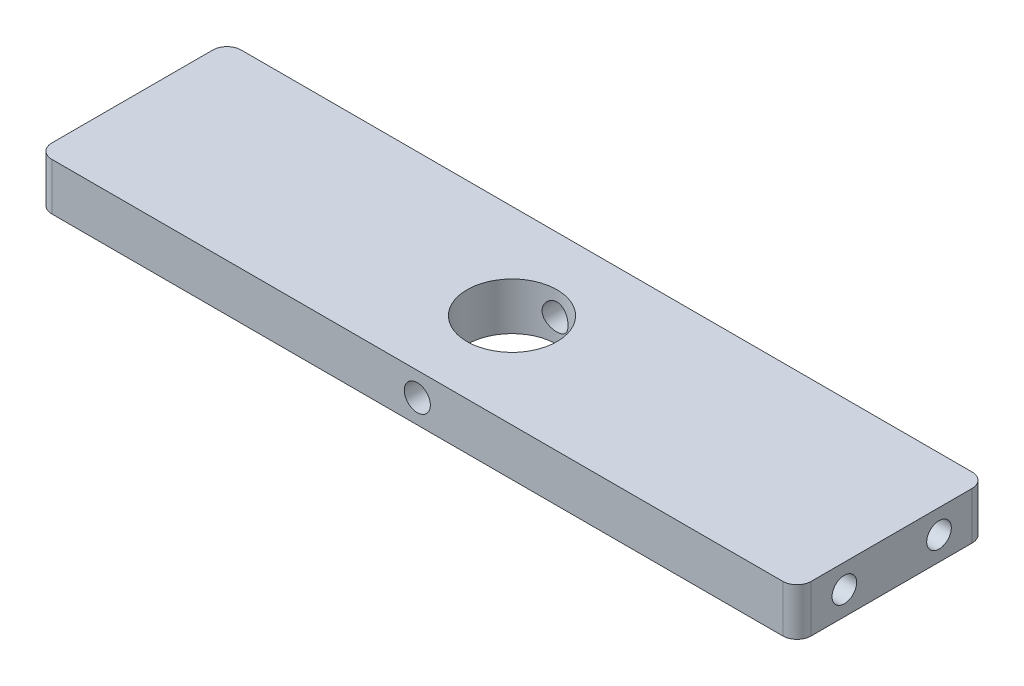
ISO-10303-21;
HEADER;
FILE_DESCRIPTION(('STEP AP214'),'2;1');
FILE_NAME('part.step','',(''),(''),'','','');
FILE_SCHEMA(('AUTOMOTIVE_DESIGN { 1 0 10303 214 1 1 1 1 }'));
ENDSEC;
DATA;
#1=APPLICATION_CONTEXT('core data for automotive mechanical design processes');
#2=APPLICATION_PROTOCOL_DEFINITION('international standard','automotive_design',2000,#1);
#3=PRODUCT_CONTEXT('',#1,'mechanical');
#4=PRODUCT('Part','Part','',(#3));
#5=PRODUCT_RELATED_PRODUCT_CATEGORY('part','',(#4));
#6=PRODUCT_DEFINITION_FORMATION('','',#4);
#7=PRODUCT_DEFINITION_CONTEXT('part definition',#1,'design');
#8=PRODUCT_DEFINITION('design','',#6,#7);
#9=PRODUCT_DEFINITION_SHAPE('','',#8);
#10=(LENGTH_UNIT() NAMED_UNIT(*) SI_UNIT(.MILLI.,.METRE.));
#11=(NAMED_UNIT(*) PLANE_ANGLE_UNIT() SI_UNIT($,.RADIAN.));
#12=(NAMED_UNIT(*) SI_UNIT($,.STERADIAN.) SOLID_ANGLE_UNIT());
#13=UNCERTAINTY_MEASURE_WITH_UNIT(LENGTH_MEASURE(1.E-05),#10,'distance_accuracy_value','');
#14=(GEOMETRIC_REPRESENTATION_CONTEXT(3) GLOBAL_UNCERTAINTY_ASSIGNED_CONTEXT((#13)) GLOBAL_UNIT_ASSIGNED_CONTEXT((#10,
#11,#12)) REPRESENTATION_CONTEXT('',''));
#15=CARTESIAN_POINT('',(0.,0.,0.));
#16=DIRECTION('',(0.,0.,1.));
#17=DIRECTION('',(1.,0.,0.));
#18=AXIS2_PLACEMENT_3D('',#15,#16,#17);
#19=CARTESIAN_POINT('',(0.,5.,0.));
#20=DIRECTION('',(0.,1.,0.));
#21=DIRECTION('',(0.,0.,1.));
#22=AXIS2_PLACEMENT_3D('',#19,#20,#21);
#23=PLANE('',#22);
#24=DIRECTION('',(1.,0.,0.));
#25=VECTOR('',#24,1.);
#26=CARTESIAN_POINT('',(80.2,5.,20.));
#27=LINE('',#26,#25);
#28=CARTESIAN_POINT('',(-77.2,5.,20.));
#29=VERTEX_POINT('',#28);
#30=CARTESIAN_POINT('',(77.2,5.,20.));
#31=VERTEX_POINT('',#30);
#32=EDGE_CURVE('E164',#29,#31,#27,.T.);
#33=ORIENTED_EDGE('',*,*,#32,.T.);
#34=CARTESIAN_POINT('',(77.2,5.,17.));
#35=DIRECTION('',(0.,1.,0.));
#36=DIRECTION('',(0.,0.,1.));
#37=AXIS2_PLACEMENT_3D('',#34,#35,#36);
#38=CIRCLE('',#37,3.);
#39=CARTESIAN_POINT('',(80.2,5.,17.));
#40=VERTEX_POINT('',#39);
#41=EDGE_CURVE('E204',#31,#40,#38,.T.);
#42=ORIENTED_EDGE('',*,*,#41,.T.);
#43=DIRECTION('',(0.,0.,-1.));
#44=VECTOR('',#43,1.);
#45=CARTESIAN_POINT('',(80.2,5.,20.));
#46=LINE('',#45,#44);
#47=CARTESIAN_POINT('',(80.2,5.,-17.));
#48=VERTEX_POINT('',#47);
#49=EDGE_CURVE('E168',#40,#48,#46,.T.);
#50=ORIENTED_EDGE('',*,*,#49,.T.);
#51=CARTESIAN_POINT('',(77.2,5.,-17.));
#52=DIRECTION('',(0.,1.,0.));
#53=DIRECTION('',(0.,0.,1.));
#54=AXIS2_PLACEMENT_3D('',#51,#52,#53);
#55=CIRCLE('',#54,3.);
#56=CARTESIAN_POINT('',(77.2,5.,-20.));
#57=VERTEX_POINT('',#56);
#58=EDGE_CURVE('E66',#48,#57,#55,.T.);
#59=ORIENTED_EDGE('',*,*,#58,.T.);
#60=DIRECTION('',(-1.,0.,0.));
#61=VECTOR('',#60,1.);
#62=CARTESIAN_POINT('',(80.2,5.,-20.));
#63=LINE('',#62,#61);
#64=CARTESIAN_POINT('',(-77.2,5.,-20.));
#65=VERTEX_POINT('',#64);
#66=EDGE_CURVE('E170',#57,#65,#63,.T.);
#67=ORIENTED_EDGE('',*,*,#66,.T.);
#68=CARTESIAN_POINT('',(-77.2,5.,-17.));
#69=DIRECTION('',(0.,1.,0.));
#70=DIRECTION('',(0.,0.,1.));
#71=AXIS2_PLACEMENT_3D('',#68,#69,#70);
#72=CIRCLE('',#71,3.);
#73=CARTESIAN_POINT('',(-80.2,5.,-17.));
#74=VERTEX_POINT('',#73);
#75=EDGE_CURVE('E199',#65,#74,#72,.T.);
#76=ORIENTED_EDGE('',*,*,#75,.T.);
#77=DIRECTION('',(0.,0.,1.));
#78=VECTOR('',#77,1.);
#79=CARTESIAN_POINT('',(-80.2,5.,20.));
#80=LINE('',#79,#78);
#81=CARTESIAN_POINT('',(-80.2,5.,17.));
#82=VERTEX_POINT('',#81);
#83=EDGE_CURVE('E161',#74,#82,#80,.T.);
#84=ORIENTED_EDGE('',*,*,#83,.T.);
#85=CARTESIAN_POINT('',(-77.2,5.,17.));
#86=DIRECTION('',(0.,1.,0.));
#87=DIRECTION('',(0.,0.,1.));
#88=AXIS2_PLACEMENT_3D('',#85,#86,#87);
#89=CIRCLE('',#88,3.);
#90=EDGE_CURVE('E201',#82,#29,#89,.T.);
#91=ORIENTED_EDGE('',*,*,#90,.T.);
#92=EDGE_LOOP('',(#33,#42,#50,#59,#67,#76,#84,#91));
#93=FACE_BOUND('',#92,.T.);
#94=CARTESIAN_POINT('',(0.,5.,0.));
#95=DIRECTION('',(0.,1.,0.));
#96=DIRECTION('',(0.,0.,1.));
#97=AXIS2_PLACEMENT_3D('',#94,#95,#96);
#98=CIRCLE('',#97,9.5);
#99=CARTESIAN_POINT('',(0.,5.,9.50000000000001));
#100=VERTEX_POINT('',#99);
#101=EDGE_CURVE('E155',#100,#100,#98,.T.);
#102=ORIENTED_EDGE('',*,*,#101,.F.);
#103=EDGE_LOOP('',(#102));
#104=FACE_BOUND('',#103,.T.);
#105=ADVANCED_FACE('F37',(#93,#104),#23,.T.);
#106=CARTESIAN_POINT('',(0.,-5.,0.));
#107=DIRECTION('',(0.,1.,0.));
#108=DIRECTION('',(0.,0.,1.));
#109=AXIS2_PLACEMENT_3D('',#106,#107,#108);
#110=PLANE('',#109);
#111=DIRECTION('',(0.,0.,-1.));
#112=VECTOR('',#111,1.);
#113=CARTESIAN_POINT('',(80.2,-5.,20.));
#114=LINE('',#113,#112);
#115=CARTESIAN_POINT('',(80.2,-5.,17.));
#116=VERTEX_POINT('',#115);
#117=CARTESIAN_POINT('',(80.2,-5.,-17.));
#118=VERTEX_POINT('',#117);
#119=EDGE_CURVE('E178',#116,#118,#114,.T.);
#120=ORIENTED_EDGE('',*,*,#119,.F.);
#121=CARTESIAN_POINT('',(77.2,-5.,17.));
#122=DIRECTION('',(0.,1.,0.));
#123=DIRECTION('',(0.,0.,1.));
#124=AXIS2_PLACEMENT_3D('',#121,#122,#123);
#125=CIRCLE('',#124,3.);
#126=CARTESIAN_POINT('',(77.2,-5.,20.));
#127=VERTEX_POINT('',#126);
#128=EDGE_CURVE('E192',#116,#127,#125,.F.);
#129=ORIENTED_EDGE('',*,*,#128,.T.);
#130=DIRECTION('',(1.,0.,0.));
#131=VECTOR('',#130,1.);
#132=CARTESIAN_POINT('',(80.2,-5.,20.));
#133=LINE('',#132,#131);
#134=CARTESIAN_POINT('',(-77.2,-5.,20.));
#135=VERTEX_POINT('',#134);
#136=EDGE_CURVE('E175',#135,#127,#133,.T.);
#137=ORIENTED_EDGE('',*,*,#136,.F.);
#138=CARTESIAN_POINT('',(-77.2,-5.,17.));
#139=DIRECTION('',(0.,1.,0.));
#140=DIRECTION('',(0.,0.,1.));
#141=AXIS2_PLACEMENT_3D('',#138,#139,#140);
#142=CIRCLE('',#141,3.);
#143=CARTESIAN_POINT('',(-80.2,-5.,17.));
#144=VERTEX_POINT('',#143);
#145=EDGE_CURVE('E188',#135,#144,#142,.F.);
#146=ORIENTED_EDGE('',*,*,#145,.T.);
#147=DIRECTION('',(0.,0.,1.));
#148=VECTOR('',#147,1.);
#149=CARTESIAN_POINT('',(-80.2,-5.,20.));
#150=LINE('',#149,#148);
#151=CARTESIAN_POINT('',(-80.2,-5.,-17.));
#152=VERTEX_POINT('',#151);
#153=EDGE_CURVE('E158',#152,#144,#150,.T.);
#154=ORIENTED_EDGE('',*,*,#153,.F.);
#155=CARTESIAN_POINT('',(-77.2,-5.,-17.));
#156=DIRECTION('',(0.,1.,0.));
#157=DIRECTION('',(0.,0.,1.));
#158=AXIS2_PLACEMENT_3D('',#155,#156,#157);
#159=CIRCLE('',#158,3.);
#160=CARTESIAN_POINT('',(-77.2,-5.,-20.));
#161=VERTEX_POINT('',#160);
#162=EDGE_CURVE('E186',#152,#161,#159,.F.);
#163=ORIENTED_EDGE('',*,*,#162,.T.);
#164=DIRECTION('',(-1.,0.,0.));
#165=VECTOR('',#164,1.);
#166=CARTESIAN_POINT('',(80.2,-5.,-20.));
#167=LINE('',#166,#165);
#168=CARTESIAN_POINT('',(77.2,-5.,-20.));
#169=VERTEX_POINT('',#168);
#170=EDGE_CURVE('E165',#169,#161,#167,.T.);
#171=ORIENTED_EDGE('',*,*,#170,.F.);
#172=CARTESIAN_POINT('',(77.2,-5.,-17.));
#173=DIRECTION('',(0.,1.,0.));
#174=DIRECTION('',(0.,0.,1.));
#175=AXIS2_PLACEMENT_3D('',#172,#173,#174);
#176=CIRCLE('',#175,3.);
#177=EDGE_CURVE('E190',#169,#118,#176,.F.);
#178=ORIENTED_EDGE('',*,*,#177,.T.);
#179=EDGE_LOOP('',(#120,#129,#137,#146,#154,#163,#171,#178));
#180=FACE_BOUND('',#179,.T.);
#181=CARTESIAN_POINT('',(0.,-5.,0.));
#182=DIRECTION('',(0.,1.,0.));
#183=DIRECTION('',(0.,0.,1.));
#184=AXIS2_PLACEMENT_3D('',#181,#182,#183);
#185=CIRCLE('',#184,9.5);
#186=CARTESIAN_POINT('',(0.,-5.,9.50000000000001));
#187=VERTEX_POINT('',#186);
#188=EDGE_CURVE('E154',#187,#187,#185,.T.);
#189=ORIENTED_EDGE('',*,*,#188,.T.);
#190=EDGE_LOOP('',(#189));
#191=FACE_BOUND('',#190,.T.);
#192=ADVANCED_FACE('F259',(#180,#191),#110,.F.);
#193=CARTESIAN_POINT('',(-80.2,5.,20.));
#194=DIRECTION('',(1.,0.,0.));
#195=DIRECTION('',(0.,0.,-1.));
#196=AXIS2_PLACEMENT_3D('',#193,#194,#195);
#197=PLANE('',#196);
#198=CARTESIAN_POINT('',(-80.2,0.,-9.99999999999999));
#199=DIRECTION('',(-1.,0.,0.));
#200=DIRECTION('',(0.,0.,1.));
#201=AXIS2_PLACEMENT_3D('',#198,#199,#200);
#202=CIRCLE('',#201,2.59999999999999);
#203=CARTESIAN_POINT('',(-80.2,0.,-7.4));
#204=VERTEX_POINT('',#203);
#205=EDGE_CURVE('E142',#204,#204,#202,.T.);
#206=ORIENTED_EDGE('',*,*,#205,.F.);
#207=EDGE_LOOP('',(#206));
#208=FACE_BOUND('',#207,.T.);
#209=CARTESIAN_POINT('',(-80.2,0.,10.));
#210=DIRECTION('',(-1.,0.,0.));
#211=DIRECTION('',(0.,0.,1.));
#212=AXIS2_PLACEMENT_3D('',#209,#210,#211);
#213=CIRCLE('',#212,2.59999999999999);
#214=CARTESIAN_POINT('',(-80.2,0.,12.6));
#215=VERTEX_POINT('',#214);
#216=EDGE_CURVE('E148',#215,#215,#213,.T.);
#217=ORIENTED_EDGE('',*,*,#216,.F.);
#218=EDGE_LOOP('',(#217));
#219=FACE_BOUND('',#218,.T.);
#220=ORIENTED_EDGE('',*,*,#153,.T.);
#221=DIRECTION('',(0.,-1.,0.));
#222=VECTOR('',#221,1.);
#223=CARTESIAN_POINT('',(-80.2,5.,17.));
#224=LINE('',#223,#222);
#225=EDGE_CURVE('E11',#144,#82,#224,.F.);
#226=ORIENTED_EDGE('',*,*,#225,.T.);
#227=ORIENTED_EDGE('',*,*,#83,.F.);
#228=DIRECTION('',(0.,-1.,0.));
#229=VECTOR('',#228,1.);
#230=CARTESIAN_POINT('',(-80.2,5.,-17.));
#231=LINE('',#230,#229);
#232=EDGE_CURVE('E51',#74,#152,#231,.T.);
#233=ORIENTED_EDGE('',*,*,#232,.T.);
#234=EDGE_LOOP('',(#220,#226,#227,#233));
#235=FACE_BOUND('',#234,.T.);
#236=ADVANCED_FACE('F263',(#208,#219,#235),#197,.F.);
#237=CARTESIAN_POINT('',(80.2,5.,20.));
#238=DIRECTION('',(0.,0.,-1.));
#239=DIRECTION('',(-1.,0.,0.));
#240=AXIS2_PLACEMENT_3D('',#237,#238,#239);
#241=PLANE('',#240);
#242=CARTESIAN_POINT('',(0.,0.,20.));
#243=DIRECTION('',(0.,0.,-1.));
#244=DIRECTION('',(-1.,0.,0.));
#245=AXIS2_PLACEMENT_3D('',#242,#243,#244);
#246=CIRCLE('',#245,2.74999999999999);
#247=CARTESIAN_POINT('',(-2.74999999999999,0.,20.));
#248=VERTEX_POINT('',#247);
#249=EDGE_CURVE('E216',#248,#248,#246,.T.);
#250=ORIENTED_EDGE('',*,*,#249,.T.);
#251=EDGE_LOOP('',(#250));
#252=FACE_BOUND('',#251,.T.);
#253=ORIENTED_EDGE('',*,*,#136,.T.);
#254=DIRECTION('',(0.,-1.,0.));
#255=VECTOR('',#254,1.);
#256=CARTESIAN_POINT('',(77.2,5.,20.));
#257=LINE('',#256,#255);
#258=EDGE_CURVE('E197',#127,#31,#257,.F.);
#259=ORIENTED_EDGE('',*,*,#258,.T.);
#260=ORIENTED_EDGE('',*,*,#32,.F.);
#261=DIRECTION('',(0.,-1.,0.));
#262=VECTOR('',#261,1.);
#263=CARTESIAN_POINT('',(-77.2,5.,20.));
#264=LINE('',#263,#262);
#265=EDGE_CURVE('E194',#29,#135,#264,.T.);
#266=ORIENTED_EDGE('',*,*,#265,.T.);
#267=EDGE_LOOP('',(#253,#259,#260,#266));
#268=FACE_BOUND('',#267,.T.);
#269=ADVANCED_FACE('F274',(#252,#268),#241,.F.);
#270=CARTESIAN_POINT('',(80.2,5.,20.));
#271=DIRECTION('',(-1.,0.,0.));
#272=DIRECTION('',(0.,0.,1.));
#273=AXIS2_PLACEMENT_3D('',#270,#271,#272);
#274=PLANE('',#273);
#275=CARTESIAN_POINT('',(80.2,0.,-9.99999999999999));
#276=DIRECTION('',(1.,0.,0.));
#277=DIRECTION('',(0.,0.,-1.));
#278=AXIS2_PLACEMENT_3D('',#275,#276,#277);
#279=CIRCLE('',#278,2.59999999999999);
#280=CARTESIAN_POINT('',(80.2,0.,-12.6));
#281=VERTEX_POINT('',#280);
#282=EDGE_CURVE('E131',#281,#281,#279,.T.);
#283=ORIENTED_EDGE('',*,*,#282,.F.);
#284=EDGE_LOOP('',(#283));
#285=FACE_BOUND('',#284,.T.);
#286=CARTESIAN_POINT('',(80.2,0.,10.));
#287=DIRECTION('',(1.,0.,0.));
#288=DIRECTION('',(0.,0.,-1.));
#289=AXIS2_PLACEMENT_3D('',#286,#287,#288);
#290=CIRCLE('',#289,2.59999999999999);
#291=CARTESIAN_POINT('',(80.2,0.,7.40000000000002));
#292=VERTEX_POINT('',#291);
#293=EDGE_CURVE('E130',#292,#292,#290,.T.);
#294=ORIENTED_EDGE('',*,*,#293,.F.);
#295=EDGE_LOOP('',(#294));
#296=FACE_BOUND('',#295,.T.);
#297=ORIENTED_EDGE('',*,*,#49,.F.);
#298=DIRECTION('',(0.,-1.,0.));
#299=VECTOR('',#298,1.);
#300=CARTESIAN_POINT('',(80.2,5.,17.));
#301=LINE('',#300,#299);
#302=EDGE_CURVE('E183',#40,#116,#301,.T.);
#303=ORIENTED_EDGE('',*,*,#302,.T.);
#304=ORIENTED_EDGE('',*,*,#119,.T.);
#305=DIRECTION('',(0.,-1.,0.));
#306=VECTOR('',#305,1.);
#307=CARTESIAN_POINT('',(80.2,5.,-17.));
#308=LINE('',#307,#306);
#309=EDGE_CURVE('E172',#118,#48,#308,.F.);
#310=ORIENTED_EDGE('',*,*,#309,.T.);
#311=EDGE_LOOP('',(#297,#303,#304,#310));
#312=FACE_BOUND('',#311,.T.);
#313=ADVANCED_FACE('F270',(#285,#296,#312),#274,.F.);
#314=CARTESIAN_POINT('',(80.2,5.,-20.));
#315=DIRECTION('',(0.,0.,1.));
#316=DIRECTION('',(1.,0.,0.));
#317=AXIS2_PLACEMENT_3D('',#314,#315,#316);
#318=PLANE('',#317);
#319=CARTESIAN_POINT('',(0.,0.,-20.));
#320=DIRECTION('',(0.,0.,-1.));
#321=DIRECTION('',(-1.,0.,0.));
#322=AXIS2_PLACEMENT_3D('',#319,#320,#321);
#323=CIRCLE('',#322,2.74999999999999);
#324=CARTESIAN_POINT('',(-2.74999999999999,0.,-20.));
#325=VERTEX_POINT('',#324);
#326=EDGE_CURVE('E487',#325,#325,#323,.T.);
#327=ORIENTED_EDGE('',*,*,#326,.F.);
#328=EDGE_LOOP('',(#327));
#329=FACE_BOUND('',#328,.T.);
#330=ORIENTED_EDGE('',*,*,#66,.F.);
#331=DIRECTION('',(0.,-1.,0.));
#332=VECTOR('',#331,1.);
#333=CARTESIAN_POINT('',(77.2,5.,-20.));
#334=LINE('',#333,#332);
#335=EDGE_CURVE('E207',#57,#169,#334,.T.);
#336=ORIENTED_EDGE('',*,*,#335,.T.);
#337=ORIENTED_EDGE('',*,*,#170,.T.);
#338=DIRECTION('',(0.,-1.,0.));
#339=VECTOR('',#338,1.);
#340=CARTESIAN_POINT('',(-77.2,5.,-20.));
#341=LINE('',#340,#339);
#342=EDGE_CURVE('E59',#161,#65,#341,.F.);
#343=ORIENTED_EDGE('',*,*,#342,.T.);
#344=EDGE_LOOP('',(#330,#336,#337,#343));
#345=FACE_BOUND('',#344,.T.);
#346=ADVANCED_FACE('F255',(#329,#345),#318,.F.);
#347=CARTESIAN_POINT('',(0.,5.,0.));
#348=DIRECTION('',(0.,-1.,0.));
#349=DIRECTION('',(0.,0.,-1.));
#350=AXIS2_PLACEMENT_3D('',#347,#348,#349);
#351=CYLINDRICAL_SURFACE('',#350,9.5);
#352=CARTESIAN_POINT('',(0.,2.74999999999999,-9.49999999999999));
#353=CARTESIAN_POINT('',(-0.151103684405157,2.74999754124777,-9.49999832244704));
#354=CARTESIAN_POINT('',(-0.302232490543062,2.73750454335048,-9.49636009363154));
#355=CARTESIAN_POINT('',(-0.600104468590077,2.68797129048408,-9.48220118050607));
#356=CARTESIAN_POINT('',(-0.746846052747299,2.65092225834138,-9.47167803530685));
#357=CARTESIAN_POINT('',(-1.03160321111771,2.55360637078811,-9.44490511841536));
#358=CARTESIAN_POINT('',(-1.16963081556959,2.49337237751823,-9.42866345486217));
#359=CARTESIAN_POINT('',(-1.43362680551053,2.35152697754196,-9.39215081459136));
#360=CARTESIAN_POINT('',(-1.55959383673314,2.26991317395903,-9.37187938616094));
#361=CARTESIAN_POINT('',(-1.79928390939949,2.08530821731493,-9.32886791379249));
#362=CARTESIAN_POINT('',(-1.91263626798143,1.98184695218117,-9.30607995192475));
#363=CARTESIAN_POINT('',(-2.12064810193771,1.75748683780256,-9.26089657094851));
#364=CARTESIAN_POINT('',(-2.21530468820945,1.63658529845747,-9.23850121299656));
#365=CARTESIAN_POINT('',(-2.3851412003241,1.37769858838737,-9.1961374284627));
#366=CARTESIAN_POINT('',(-2.45987724499969,1.23941151163317,-9.17622885775419));
#367=CARTESIAN_POINT('',(-2.58488523493734,0.951563505842819,-9.14180519471755));
#368=CARTESIAN_POINT('',(-2.63516260005811,0.802005082942984,-9.12728890766878));
#369=CARTESIAN_POINT('',(-2.70850546492159,0.500004433916435,-9.1057912455198));
#370=CARTESIAN_POINT('',(-2.73225075845376,0.347741018028173,-9.09862204672375));
#371=CARTESIAN_POINT('',(-2.75397717672036,0.0412359070571991,-9.09207071188814));
#372=CARTESIAN_POINT('',(-2.75196406431899,-0.113005337816634,-9.09268683405768));
#373=CARTESIAN_POINT('',(-2.72276662670943,-0.413634335356509,-9.10146952020892));
#374=CARTESIAN_POINT('',(-2.69642417137727,-0.560112434957022,-9.10938354042197));
#375=CARTESIAN_POINT('',(-2.62067211905443,-0.846474583113476,-9.13146312538767));
#376=CARTESIAN_POINT('',(-2.5712603872788,-0.986358020093244,-9.1456292686927));
#377=CARTESIAN_POINT('',(-2.45013108041959,-1.25766325857889,-9.17882509752256));
#378=CARTESIAN_POINT('',(-2.37813330895177,-1.38895224019629,-9.19791530942063));
#379=CARTESIAN_POINT('',(-2.21407061426737,-1.63787169462001,-9.23877807968907));
#380=CARTESIAN_POINT('',(-2.12200112000823,-1.75549904682108,-9.26055124857193));
#381=CARTESIAN_POINT('',(-1.91618685498142,-1.97854309496557,-9.3053597726663));
#382=CARTESIAN_POINT('',(-1.80174061950394,-2.08331030255787,-9.32841134979004));
#383=CARTESIAN_POINT('',(-1.55661714618185,-2.27231056222138,-9.37242908900899));
#384=CARTESIAN_POINT('',(-1.42593902284807,-2.35654249329973,-9.39339513722105));
#385=CARTESIAN_POINT('',(-1.15093833312673,-2.50243927488955,-9.43104916921502));
#386=CARTESIAN_POINT('',(-1.00654019019467,-2.56396878066789,-9.44771132340433));
#387=CARTESIAN_POINT('',(-0.708852909931501,-2.66168204194398,-9.47469408752444));
#388=CARTESIAN_POINT('',(-0.555566086357655,-2.69787236154338,-9.48501633971808));
#389=CARTESIAN_POINT('',(-0.24998107430183,-2.74281889776172,-9.49790021134739));
#390=CARTESIAN_POINT('',(-0.0978227914435337,-2.7524562282378,-9.50071098704387));
#391=CARTESIAN_POINT('',(0.205942559875623,-2.74648095244812,-9.49898138198389));
#392=CARTESIAN_POINT('',(0.357549694070784,-2.73087146342334,-9.49444190876729));
#393=CARTESIAN_POINT('',(0.652642778569646,-2.67556180638033,-9.47868434388846));
#394=CARTESIAN_POINT('',(0.79623201103296,-2.63636883617609,-9.46760695334968));
#395=CARTESIAN_POINT('',(1.0747718814908,-2.53560800406058,-9.44004611204557));
#396=CARTESIAN_POINT('',(1.20972150725607,-2.47403752598894,-9.4235620292044));
#397=CARTESIAN_POINT('',(1.47045331248785,-2.3287401729985,-9.38645317249359));
#398=CARTESIAN_POINT('',(1.59596781480529,-2.24455478541085,-9.3657451285769));
#399=CARTESIAN_POINT('',(1.83139177054953,-2.05698055414271,-9.32257224582276));
#400=CARTESIAN_POINT('',(1.94129756906272,-1.95358722579483,-9.30010699742408));
#401=CARTESIAN_POINT('',(2.14621104649742,-1.72639898636424,-9.25500783915002));
#402=CARTESIAN_POINT('',(2.24059318661215,-1.60203477635804,-9.23239367776249));
#403=CARTESIAN_POINT('',(2.40718239059993,-1.33874440341558,-9.19036893236843));
#404=CARTESIAN_POINT('',(2.47939018279238,-1.19981871895394,-9.17095824315311));
#405=CARTESIAN_POINT('',(2.59906135276598,-0.911894033414351,-9.13776453706623));
#406=CARTESIAN_POINT('',(2.64665229406023,-0.762951576021275,-9.12395259006894));
#407=CARTESIAN_POINT('',(2.71595633948742,-0.458698395809335,-9.10356585395777));
#408=CARTESIAN_POINT('',(2.73767754597491,-0.303389682662652,-9.09698879893802));
#409=CARTESIAN_POINT('',(2.75410126157505,0.00272100951974566,-9.09202893674775));
#410=CARTESIAN_POINT('',(2.74981852412951,0.153464301427592,-9.09333835862443));
#411=CARTESIAN_POINT('',(2.71675579324348,0.451982007282177,-9.10327026037627));
#412=CARTESIAN_POINT('',(2.68797665822231,0.599756525076961,-9.11189248399127));
#413=CARTESIAN_POINT('',(2.60737233149368,0.886608661207581,-9.13527934560715));
#414=CARTESIAN_POINT('',(2.55579824435838,1.02576270187393,-9.14997694724351));
#415=CARTESIAN_POINT('',(2.43126245291441,1.29355306042231,-9.18385041129181));
#416=CARTESIAN_POINT('',(2.35829688090382,1.42218747091165,-9.20302708341754));
#417=CARTESIAN_POINT('',(2.19012593088044,1.6700407247756,-9.24451630224842));
#418=CARTESIAN_POINT('',(2.09424562749777,1.78878745087847,-9.26691363088848));
#419=CARTESIAN_POINT('',(1.8842041101317,2.00883518550836,-9.31188982023243));
#420=CARTESIAN_POINT('',(1.77003826301001,2.11013175902883,-9.33446872556291));
#421=CARTESIAN_POINT('',(1.52301108308858,2.29507449070068,-9.37798262689348));
#422=CARTESIAN_POINT('',(1.38973368573321,2.37818030668016,-9.3988580217393));
#423=CARTESIAN_POINT('',(1.11049416144359,2.52068290210943,-9.43591993772834));
#424=CARTESIAN_POINT('',(0.964538760766332,2.58009216122512,-9.45210892570754));
#425=CARTESIAN_POINT('',(0.683003090577108,2.66738259861147,-9.47633414525844));
#426=CARTESIAN_POINT('',(0.548418661837644,2.69828426160835,-9.48513842472121));
#427=CARTESIAN_POINT('',(0.275896149880606,2.73959263042157,-9.49697170809104));
#428=CARTESIAN_POINT('',(0.137958545422938,2.75000224485511,-9.50000153161563));
#429=CARTESIAN_POINT('',(0.,2.74999999999999,-9.49999999999999));
#430=B_SPLINE_CURVE_WITH_KNOTS('',3,(#352,#353,#354,#355,#356,#357,#358,#359,#360,#361,#362,
#363,#364,#365,#366,#367,#368,#369,#370,#371,#372,#373,#374,#375,#376,#377,#378,#379,#380,#381,
#382,#383,#384,#385,#386,#387,#388,#389,#390,#391,#392,#393,#394,#395,#396,#397,#398,#399,#400,
#401,#402,#403,#404,#405,#406,#407,#408,#409,#410,#411,#412,#413,#414,#415,#416,#417,#418,#419,
#420,#421,#422,#423,#424,#425,#426,#427,#428,#429),.UNSPECIFIED.,.T.,.F.,(4,2,2,2,2,2,2,2,2,2,2,
2,2,2,2,2,2,2,2,2,2,2,2,2,2,2,2,2,2,2,2,2,2,2,2,2,2,2,4),(0.,0.452804573289333,
0.905771081895441,1.35809791035427,1.81047547059562,2.27381553554251,2.73722714561843,
3.21023444408136,3.68313687990035,4.14362319086672,4.60400648017588,5.04903287760034,
5.4941004650469,5.94492368071086,6.39584967224767,6.86424271505823,7.3326613210863,
7.80382901933557,8.27487461665875,8.73008958851485,9.18524835897749,9.63095163111832,
10.0767070273173,10.5322890334959,10.9879775428881,11.4589952340736,11.9299974529658,
12.3985338697172,12.8669235030808,13.3171557415862,13.7673722033992,14.2127481976107,
14.6582047680457,15.1188873659056,15.5796868753881,16.0527270031476,16.5255176768594,
16.9389895859487,17.3524028030901),.UNSPECIFIED.);
#431=CARTESIAN_POINT('',(0.,2.74999999999999,-9.49999999999999));
#432=VERTEX_POINT('',#431);
#433=EDGE_CURVE('E41',#432,#432,#430,.T.);
#434=ORIENTED_EDGE('',*,*,#433,.F.);
#435=EDGE_LOOP('',(#434));
#436=FACE_BOUND('',#435,.T.);
#437=CARTESIAN_POINT('',(-2.74999999999999,0.,9.09326673973662));
#438=CARTESIAN_POINT('',(-2.74999748739826,0.150953997952812,9.0932687234266));
#439=CARTESIAN_POINT('',(-2.73752836043792,0.30193320221528,9.09706676491743));
#440=CARTESIAN_POINT('',(-2.68809850739297,0.599495166690835,9.11179297629922));
#441=CARTESIAN_POINT('',(-2.65112828541667,0.7460761992712,9.12272391066089));
#442=CARTESIAN_POINT('',(-2.55404261737731,1.03049237957935,9.15037642687374));
#443=CARTESIAN_POINT('',(-2.49396369429824,1.16834093046682,9.16708886696219));
#444=CARTESIAN_POINT('',(-2.35248438083627,1.43203232307547,9.2044091953515));
#445=CARTESIAN_POINT('',(-2.2710812851814,1.55787363874416,9.22501757781518));
#446=CARTESIAN_POINT('',(-2.08669738026416,1.79768605462858,9.26848858321332));
#447=CARTESIAN_POINT('',(-1.98319895966932,1.91125102911558,9.29139667056131));
#448=CARTESIAN_POINT('',(-1.7586729151014,2.1196787486956,9.33649625564446));
#449=CARTESIAN_POINT('',(-1.63764319087852,2.21453924977346,9.35868766713176));
#450=CARTESIAN_POINT('',(-1.37862488560984,2.38460579860939,9.40036700016277));
#451=CARTESIAN_POINT('',(-1.24035617051953,2.45940113657735,9.4197950820437));
#452=CARTESIAN_POINT('',(-0.952546748651445,2.58452360437367,9.45323267734275));
#453=CARTESIAN_POINT('',(-0.803008304254653,2.63485563014175,9.46724327486865));
#454=CARTESIAN_POINT('',(-0.501150094253812,2.70828844620235,9.48794567226656));
#455=CARTESIAN_POINT('',(-0.34901175123507,2.73208169761808,9.49482323556994));
#456=CARTESIAN_POINT('',(-0.0427575868891259,2.75394753941673,9.50113730326528));
#457=CARTESIAN_POINT('',(0.111357840865043,2.75202517193673,9.50057526636177));
#458=CARTESIAN_POINT('',(0.412346021008186,2.7229866470039,9.49220634853773));
#459=CARTESIAN_POINT('',(0.55929798756627,2.69661977235507,9.48461494301188));
#460=CARTESIAN_POINT('',(0.846594418858577,2.62066022236096,9.46329962681945));
#461=CARTESIAN_POINT('',(0.986938476435692,2.57106611788768,9.44957533881047));
#462=CARTESIAN_POINT('',(1.25885921003556,2.44953101496587,9.41723137172921));
#463=CARTESIAN_POINT('',(1.39032097883386,2.37734754476926,9.39855892989722));
#464=CARTESIAN_POINT('',(1.63951063706876,2.21287253537106,9.35830968916391));
#465=CARTESIAN_POINT('',(1.75723544220935,2.12057649367597,9.33673224034829));
#466=CARTESIAN_POINT('',(1.98008241293625,1.91457948117918,9.29207535798244));
#467=CARTESIAN_POINT('',(2.0845985063612,1.80022768460242,9.26896981688192));
#468=CARTESIAN_POINT('',(2.27313434452746,1.55538915891514,9.22454700408495));
#469=CARTESIAN_POINT('',(2.35715233347622,1.42490104906865,9.20322988568079));
#470=CARTESIAN_POINT('',(2.50288155232304,1.14999160301189,9.16467885377943));
#471=CARTESIAN_POINT('',(2.56439983263043,1.00546261095701,9.14748067677288));
#472=CARTESIAN_POINT('',(2.6620528166619,0.707485933075982,9.1195440587038));
#473=CARTESIAN_POINT('',(2.69819513514645,0.554040937721674,9.10880367993903));
#474=CARTESIAN_POINT('',(2.74296654089158,0.248323982195786,9.09542000648067));
#475=CARTESIAN_POINT('',(2.75251131884848,0.0961977901220346,9.09250735225997));
#476=CARTESIAN_POINT('',(2.74636270896667,-0.207483134137307,9.09436660743294));
#477=CARTESIAN_POINT('',(2.73067256722487,-0.35903793731,9.0991375284491));
#478=CARTESIAN_POINT('',(2.67531246643312,-0.653551901521397,9.11556333018618));
#479=CARTESIAN_POINT('',(2.63621916462593,-0.796629625139111,9.12705251858283));
#480=CARTESIAN_POINT('',(2.53582439387691,-1.07418982938121,9.15545183534517));
#481=CARTESIAN_POINT('',(2.47451966099629,-1.20867104334192,9.17236276038544));
#482=CARTESIAN_POINT('',(2.32966586195411,-1.46898005406383,9.21023237443963));
#483=CARTESIAN_POINT('',(2.2455933821662,-1.59450294220978,9.23128262611337));
#484=CARTESIAN_POINT('',(2.05822094195759,-1.82999443224549,9.2748564163255));
#485=CARTESIAN_POINT('',(1.95491670148968,-1.93995956213451,9.29738028209305));
#486=CARTESIAN_POINT('',(1.72773062477627,-2.14515188711669,9.34231184375261));
#487=CARTESIAN_POINT('',(1.60325793777754,-2.23973327074385,9.36468823773964));
#488=CARTESIAN_POINT('',(1.33968263632317,-2.40667402715686,9.40600969237693));
#489=CARTESIAN_POINT('',(1.20058077950734,-2.47903454999358,9.42495493058741));
#490=CARTESIAN_POINT('',(0.912649637267854,-2.59878572717537,9.45715985552087));
#491=CARTESIAN_POINT('',(0.76390386673592,-2.64636509519229,9.4704623641226));
#492=CARTESIAN_POINT('',(0.460077462260284,-2.71571190108874,9.49007216753953));
#493=CARTESIAN_POINT('',(0.304998516156486,-2.73748617038252,9.49638131368721));
#494=CARTESIAN_POINT('',(-0.00110360027676766,-2.75411458511434,9.50118901213468));
#495=CARTESIAN_POINT('',(-0.152072094059064,-2.74990857251865,9.49996026070431));
#496=CARTESIAN_POINT('',(-0.451061285439779,-2.71692141631086,9.49046443510555));
#497=CARTESIAN_POINT('',(-0.599082130390087,-2.6881415043108,9.48219771367118));
#498=CARTESIAN_POINT('',(-0.886632373889604,-2.60739003105712,9.45962516167449));
#499=CARTESIAN_POINT('',(-1.02622846086624,-2.55563879797741,9.44537677272285));
#500=CARTESIAN_POINT('',(-1.29483253812965,-2.43060987631273,9.4123186286117));
#501=CARTESIAN_POINT('',(-1.4238388572462,-2.35732879842856,9.39350815535523));
#502=CARTESIAN_POINT('',(-1.67185152283712,-2.18873776139429,9.35260387019407));
#503=CARTESIAN_POINT('',(-1.79043576764824,-2.09282695151212,9.33042776311656));
#504=CARTESIAN_POINT('',(-2.01014226552737,-1.88279961772196,9.28557628255654));
#505=CARTESIAN_POINT('',(-2.11125962575054,-1.76867800975005,9.2629007711794));
#506=CARTESIAN_POINT('',(-2.29590967855622,-1.5217437851798,9.21889747182868));
#507=CARTESIAN_POINT('',(-2.3788899323709,-1.38850756993255,9.1976230427331));
#508=CARTESIAN_POINT('',(-2.52116782261767,-1.1093783411363,9.15964892123512));
#509=CARTESIAN_POINT('',(-2.58047823798445,-0.963492208987271,9.14294676187752));
#510=CARTESIAN_POINT('',(-2.66758164153756,-0.682186210947399,9.1178830574584));
#511=CARTESIAN_POINT('',(-2.69840768332365,-0.547769200753621,9.10873489340992));
#512=CARTESIAN_POINT('',(-2.7396162907341,-0.275574749122089,9.09642633252115));
#513=CARTESIAN_POINT('',(-2.75000229362049,-0.137797876635266,9.09326492893153));
#514=CARTESIAN_POINT('',(-2.74999999999999,0.,9.09326673973662));
#515=B_SPLINE_CURVE_WITH_KNOTS('',3,(#437,#438,#439,#440,#441,#442,#443,#444,#445,#446,#447,
#448,#449,#450,#451,#452,#453,#454,#455,#456,#457,#458,#459,#460,#461,#462,#463,#464,#465,#466,
#467,#468,#469,#470,#471,#472,#473,#474,#475,#476,#477,#478,#479,#480,#481,#482,#483,#484,#485,
#486,#487,#488,#489,#490,#491,#492,#493,#494,#495,#496,#497,#498,#499,#500,#501,#502,#503,#504,
#505,#506,#507,#508,#509,#510,#511,#512,#513,#514),.UNSPECIFIED.,.T.,.F.,(4,2,2,2,2,2,2,2,2,2,2,
2,2,2,2,2,2,2,2,2,2,2,2,2,2,2,2,2,2,2,2,2,2,2,2,2,2,2,4),(0.,0.452354225330143,
0.904883872238968,1.35670122175645,1.80857591845844,2.27250302645481,2.73648575894589,
3.20934458559213,3.68210873811819,4.14222565416551,4.60225235505727,5.04862841363625,
5.49503194050778,5.94640171918052,6.39787264758003,6.86559236955406,7.33335214063168,
7.80503408252509,8.2765744226185,8.73166742703895,9.1867018951981,9.63096083350223,
10.0752850815324,10.5308477745653,10.9865119749869,11.4580283883479,11.9295203940453,
12.3973673644645,12.8650904535168,13.3159951225511,13.766877194153,14.2135250840874,
14.6602433245154,15.1205137475931,15.5809128938304,16.0538214362182,16.52647431698,
16.9394738892603,17.352404004281),.UNSPECIFIED.);
#516=CARTESIAN_POINT('',(-2.74999999999999,0.,9.09326673973662));
#517=VERTEX_POINT('',#516);
#518=EDGE_CURVE('E211',#517,#517,#515,.T.);
#519=ORIENTED_EDGE('',*,*,#518,.F.);
#520=EDGE_LOOP('',(#519));
#521=FACE_BOUND('',#520,.T.);
#522=ORIENTED_EDGE('',*,*,#101,.T.);
#523=EDGE_LOOP('',(#522));
#524=FACE_BOUND('',#523,.T.);
#525=ORIENTED_EDGE('',*,*,#188,.F.);
#526=EDGE_LOOP('',(#525));
#527=FACE_BOUND('',#526,.T.);
#528=ADVANCED_FACE('F217',(#436,#521,#524,#527),#351,.F.);
#529=CARTESIAN_POINT('',(-50.2,0.,10.));
#530=DIRECTION('',(-1.,0.,0.));
#531=DIRECTION('',(0.,0.,1.));
#532=AXIS2_PLACEMENT_3D('',#529,#530,#531);
#533=CONICAL_SURFACE('',#532,2.6,1.02974425867665);
#534=CARTESIAN_POINT('',(-48.6377623905283,0.,10.));
#535=VERTEX_POINT('',#534);
#536=VERTEX_LOOP('',#535);
#537=FACE_BOUND('',#536,.T.);
#538=CARTESIAN_POINT('',(-50.2,0.,10.));
#539=DIRECTION('',(-1.,0.,0.));
#540=DIRECTION('',(0.,0.,1.));
#541=AXIS2_PLACEMENT_3D('',#538,#539,#540);
#542=CIRCLE('',#541,2.6);
#543=CARTESIAN_POINT('',(-50.2,0.,12.6));
#544=VERTEX_POINT('',#543);
#545=EDGE_CURVE('E151',#544,#544,#542,.T.);
#546=ORIENTED_EDGE('',*,*,#545,.T.);
#547=EDGE_LOOP('',(#546));
#548=FACE_BOUND('',#547,.T.);
#549=ADVANCED_FACE('F248',(#537,#548),#533,.F.);
#550=CARTESIAN_POINT('',(-80.2,0.,10.));
#551=DIRECTION('',(-1.,0.,0.));
#552=DIRECTION('',(0.,0.,1.));
#553=AXIS2_PLACEMENT_3D('',#550,#551,#552);
#554=CYLINDRICAL_SURFACE('',#553,2.59999999999999);
#555=ORIENTED_EDGE('',*,*,#545,.F.);
#556=EDGE_LOOP('',(#555));
#557=FACE_BOUND('',#556,.T.);
#558=ORIENTED_EDGE('',*,*,#216,.T.);
#559=EDGE_LOOP('',(#558));
#560=FACE_BOUND('',#559,.T.);
#561=ADVANCED_FACE('F245',(#557,#560),#554,.F.);
#562=CARTESIAN_POINT('',(-50.2,0.,-9.99999999999999));
#563=DIRECTION('',(-1.,0.,0.));
#564=DIRECTION('',(0.,0.,1.));
#565=AXIS2_PLACEMENT_3D('',#562,#563,#564);
#566=CONICAL_SURFACE('',#565,2.6,1.02974425867665);
#567=CARTESIAN_POINT('',(-48.6377623905283,0.,-9.99999999999999));
#568=VERTEX_POINT('',#567);
#569=VERTEX_LOOP('',#568);
#570=FACE_BOUND('',#569,.T.);
#571=CARTESIAN_POINT('',(-50.2,0.,-9.99999999999999));
#572=DIRECTION('',(-1.,0.,0.));
#573=DIRECTION('',(0.,0.,1.));
#574=AXIS2_PLACEMENT_3D('',#571,#572,#573);
#575=CIRCLE('',#574,2.6);
#576=CARTESIAN_POINT('',(-50.2,0.,-7.39999999999999));
#577=VERTEX_POINT('',#576);
#578=EDGE_CURVE('E145',#577,#577,#575,.T.);
#579=ORIENTED_EDGE('',*,*,#578,.T.);
#580=EDGE_LOOP('',(#579));
#581=FACE_BOUND('',#580,.T.);
#582=ADVANCED_FACE('F241',(#570,#581),#566,.F.);
#583=CARTESIAN_POINT('',(-80.2,0.,-9.99999999999999));
#584=DIRECTION('',(-1.,0.,0.));
#585=DIRECTION('',(0.,0.,1.));
#586=AXIS2_PLACEMENT_3D('',#583,#584,#585);
#587=CYLINDRICAL_SURFACE('',#586,2.59999999999999);
#588=ORIENTED_EDGE('',*,*,#578,.F.);
#589=EDGE_LOOP('',(#588));
#590=FACE_BOUND('',#589,.T.);
#591=ORIENTED_EDGE('',*,*,#205,.T.);
#592=EDGE_LOOP('',(#591));
#593=FACE_BOUND('',#592,.T.);
#594=ADVANCED_FACE('F237',(#590,#593),#587,.F.);
#595=CARTESIAN_POINT('',(50.2,0.,10.));
#596=DIRECTION('',(1.,0.,0.));
#597=DIRECTION('',(0.,0.,-1.));
#598=AXIS2_PLACEMENT_3D('',#595,#596,#597);
#599=CONICAL_SURFACE('',#598,2.6,1.02974425867665);
#600=CARTESIAN_POINT('',(48.6377623905283,0.,10.));
#601=VERTEX_POINT('',#600);
#602=VERTEX_LOOP('',#601);
#603=FACE_BOUND('',#602,.T.);
#604=CARTESIAN_POINT('',(50.2,0.,10.));
#605=DIRECTION('',(1.,0.,0.));
#606=DIRECTION('',(0.,0.,-1.));
#607=AXIS2_PLACEMENT_3D('',#604,#605,#606);
#608=CIRCLE('',#607,2.6);
#609=CARTESIAN_POINT('',(50.2,0.,7.40000000000001));
#610=VERTEX_POINT('',#609);
#611=EDGE_CURVE('E134',#610,#610,#608,.T.);
#612=ORIENTED_EDGE('',*,*,#611,.T.);
#613=EDGE_LOOP('',(#612));
#614=FACE_BOUND('',#613,.T.);
#615=ADVANCED_FACE('F233',(#603,#614),#599,.F.);
#616=CARTESIAN_POINT('',(80.2,0.,10.));
#617=DIRECTION('',(1.,0.,0.));
#618=DIRECTION('',(0.,0.,-1.));
#619=AXIS2_PLACEMENT_3D('',#616,#617,#618);
#620=CYLINDRICAL_SURFACE('',#619,2.59999999999999);
#621=ORIENTED_EDGE('',*,*,#611,.F.);
#622=EDGE_LOOP('',(#621));
#623=FACE_BOUND('',#622,.T.);
#624=ORIENTED_EDGE('',*,*,#293,.T.);
#625=EDGE_LOOP('',(#624));
#626=FACE_BOUND('',#625,.T.);
#627=ADVANCED_FACE('F124',(#623,#626),#620,.F.);
#628=CARTESIAN_POINT('',(50.2,0.,-9.99999999999999));
#629=DIRECTION('',(1.,0.,0.));
#630=DIRECTION('',(0.,0.,-1.));
#631=AXIS2_PLACEMENT_3D('',#628,#629,#630);
#632=CONICAL_SURFACE('',#631,2.6,1.02974425867665);
#633=CARTESIAN_POINT('',(48.6377623905283,0.,-9.99999999999999));
#634=VERTEX_POINT('',#633);
#635=VERTEX_LOOP('',#634);
#636=FACE_BOUND('',#635,.T.);
#637=CARTESIAN_POINT('',(50.2,0.,-9.99999999999999));
#638=DIRECTION('',(1.,0.,0.));
#639=DIRECTION('',(0.,0.,-1.));
#640=AXIS2_PLACEMENT_3D('',#637,#638,#639);
#641=CIRCLE('',#640,2.6);
#642=CARTESIAN_POINT('',(50.2,0.,-12.6));
#643=VERTEX_POINT('',#642);
#644=EDGE_CURVE('E128',#643,#643,#641,.T.);
#645=ORIENTED_EDGE('',*,*,#644,.T.);
#646=EDGE_LOOP('',(#645));
#647=FACE_BOUND('',#646,.T.);
#648=ADVANCED_FACE('F120',(#636,#647),#632,.F.);
#649=CARTESIAN_POINT('',(80.2,0.,-9.99999999999999));
#650=DIRECTION('',(1.,0.,0.));
#651=DIRECTION('',(0.,0.,-1.));
#652=AXIS2_PLACEMENT_3D('',#649,#650,#651);
#653=CYLINDRICAL_SURFACE('',#652,2.59999999999999);
#654=ORIENTED_EDGE('',*,*,#644,.F.);
#655=EDGE_LOOP('',(#654));
#656=FACE_BOUND('',#655,.T.);
#657=ORIENTED_EDGE('',*,*,#282,.T.);
#658=EDGE_LOOP('',(#657));
#659=FACE_BOUND('',#658,.T.);
#660=ADVANCED_FACE('F123',(#656,#659),#653,.F.);
#661=CARTESIAN_POINT('',(77.2,5.,17.));
#662=DIRECTION('',(0.,-1.,0.));
#663=DIRECTION('',(0.,0.,-1.));
#664=AXIS2_PLACEMENT_3D('',#661,#662,#663);
#665=CYLINDRICAL_SURFACE('',#664,3.);
#666=ORIENTED_EDGE('',*,*,#41,.F.);
#667=ORIENTED_EDGE('',*,*,#258,.F.);
#668=ORIENTED_EDGE('',*,*,#128,.F.);
#669=ORIENTED_EDGE('',*,*,#302,.F.);
#670=EDGE_LOOP('',(#666,#667,#668,#669));
#671=FACE_BOUND('',#670,.T.);
#672=ADVANCED_FACE('F229',(#671),#665,.T.);
#673=CARTESIAN_POINT('',(77.2,5.,-17.));
#674=DIRECTION('',(0.,-1.,0.));
#675=DIRECTION('',(0.,0.,-1.));
#676=AXIS2_PLACEMENT_3D('',#673,#674,#675);
#677=CYLINDRICAL_SURFACE('',#676,3.);
#678=ORIENTED_EDGE('',*,*,#58,.F.);
#679=ORIENTED_EDGE('',*,*,#309,.F.);
#680=ORIENTED_EDGE('',*,*,#177,.F.);
#681=ORIENTED_EDGE('',*,*,#335,.F.);
#682=EDGE_LOOP('',(#678,#679,#680,#681));
#683=FACE_BOUND('',#682,.T.);
#684=ADVANCED_FACE('F284',(#683),#677,.T.);
#685=CARTESIAN_POINT('',(-77.2,5.,17.));
#686=DIRECTION('',(0.,-1.,0.));
#687=DIRECTION('',(0.,0.,-1.));
#688=AXIS2_PLACEMENT_3D('',#685,#686,#687);
#689=CYLINDRICAL_SURFACE('',#688,3.);
#690=ORIENTED_EDGE('',*,*,#90,.F.);
#691=ORIENTED_EDGE('',*,*,#225,.F.);
#692=ORIENTED_EDGE('',*,*,#145,.F.);
#693=ORIENTED_EDGE('',*,*,#265,.F.);
#694=EDGE_LOOP('',(#690,#691,#692,#693));
#695=FACE_BOUND('',#694,.T.);
#696=ADVANCED_FACE('F287',(#695),#689,.T.);
#697=CARTESIAN_POINT('',(-77.2,5.,-17.));
#698=DIRECTION('',(0.,-1.,0.));
#699=DIRECTION('',(0.,0.,-1.));
#700=AXIS2_PLACEMENT_3D('',#697,#698,#699);
#701=CYLINDRICAL_SURFACE('',#700,3.);
#702=ORIENTED_EDGE('',*,*,#75,.F.);
#703=ORIENTED_EDGE('',*,*,#342,.F.);
#704=ORIENTED_EDGE('',*,*,#162,.F.);
#705=ORIENTED_EDGE('',*,*,#232,.F.);
#706=EDGE_LOOP('',(#702,#703,#704,#705));
#707=FACE_BOUND('',#706,.T.);
#708=ADVANCED_FACE('F39',(#707),#701,.T.);
#709=CARTESIAN_POINT('',(0.,0.,-20.));
#710=DIRECTION('',(0.,0.,-1.));
#711=DIRECTION('',(-1.,0.,0.));
#712=AXIS2_PLACEMENT_3D('',#709,#710,#711);
#713=CYLINDRICAL_SURFACE('',#712,2.74999999999999);
#714=ORIENTED_EDGE('',*,*,#518,.T.);
#715=EDGE_LOOP('',(#714));
#716=FACE_BOUND('',#715,.T.);
#717=ORIENTED_EDGE('',*,*,#249,.F.);
#718=EDGE_LOOP('',(#717));
#719=FACE_BOUND('',#718,.T.);
#720=ADVANCED_FACE('F221',(#716,#719),#713,.F.);
#721=ORIENTED_EDGE('',*,*,#433,.T.);
#722=EDGE_LOOP('',(#721));
#723=FACE_BOUND('',#722,.T.);
#724=ORIENTED_EDGE('',*,*,#326,.T.);
#725=EDGE_LOOP('',(#724));
#726=FACE_BOUND('',#725,.T.);
#727=ADVANCED_FACE('F225',(#723,#726),#713,.F.);
#728=CLOSED_SHELL('',(#105,#192,#236,#269,#313,#346,#528,#549,#561,#582,#594,#615,#627,#648,
#660,#672,#684,#696,#708,#720,#727));
#729=MANIFOLD_SOLID_BREP('B2',#728);
#730=ADVANCED_BREP_SHAPE_REPRESENTATION('',(#18,#729),#14);
#731=SHAPE_DEFINITION_REPRESENTATION(#9,#730);
ENDSEC;
END-ISO-10303-21;
